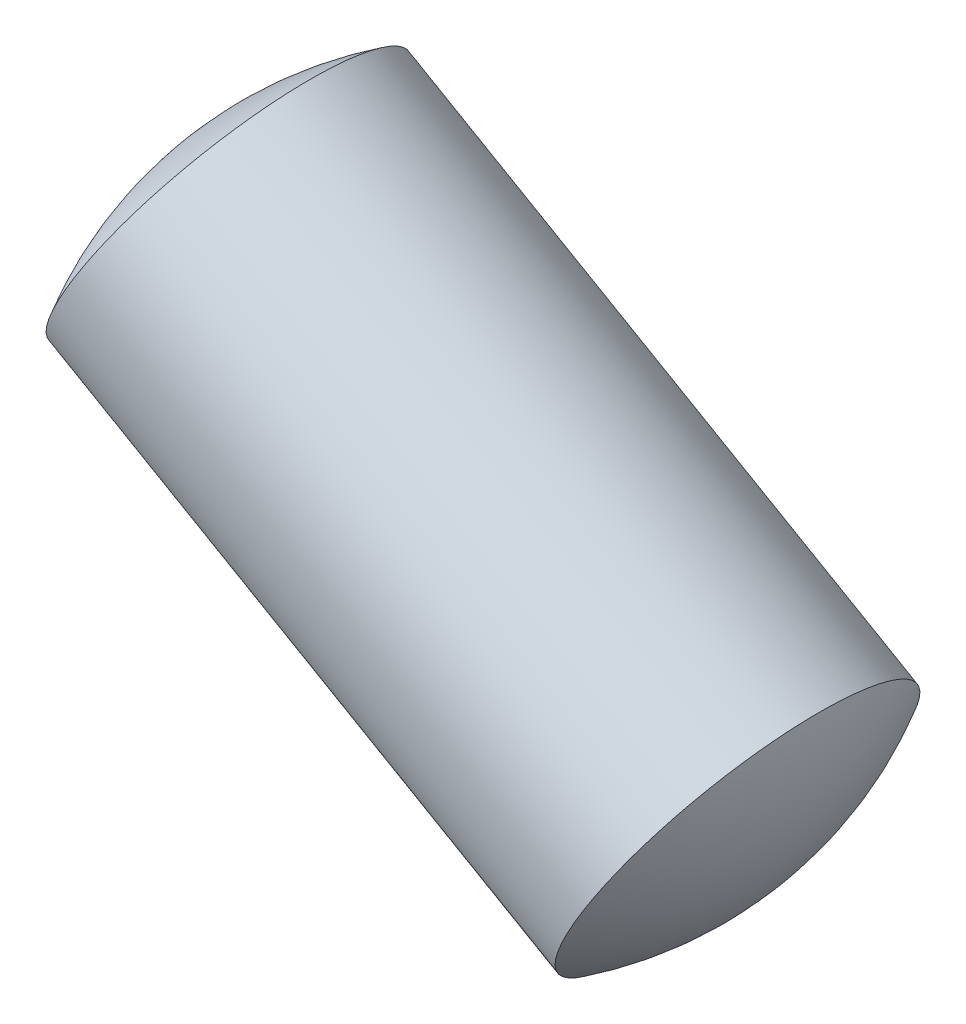
ISO-10303-21;
HEADER;
FILE_DESCRIPTION(('STEP AP214'),'2;1');
FILE_NAME('part.step','',(''),(''),'','','');
FILE_SCHEMA(('AUTOMOTIVE_DESIGN { 1 0 10303 214 1 1 1 1 }'));
ENDSEC;
DATA;
#1=APPLICATION_CONTEXT('core data for automotive mechanical design processes');
#2=APPLICATION_PROTOCOL_DEFINITION('international standard','automotive_design',2000,#1);
#3=PRODUCT_CONTEXT('',#1,'mechanical');
#4=PRODUCT('Part','Part','',(#3));
#5=PRODUCT_RELATED_PRODUCT_CATEGORY('part','',(#4));
#6=PRODUCT_DEFINITION_FORMATION('','',#4);
#7=PRODUCT_DEFINITION_CONTEXT('part definition',#1,'design');
#8=PRODUCT_DEFINITION('design','',#6,#7);
#9=PRODUCT_DEFINITION_SHAPE('','',#8);
#10=(LENGTH_UNIT() NAMED_UNIT(*) SI_UNIT(.MILLI.,.METRE.));
#11=(NAMED_UNIT(*) PLANE_ANGLE_UNIT() SI_UNIT($,.RADIAN.));
#12=(NAMED_UNIT(*) SI_UNIT($,.STERADIAN.) SOLID_ANGLE_UNIT());
#13=UNCERTAINTY_MEASURE_WITH_UNIT(LENGTH_MEASURE(1.E-05),#10,'distance_accuracy_value','');
#14=(GEOMETRIC_REPRESENTATION_CONTEXT(3) GLOBAL_UNCERTAINTY_ASSIGNED_CONTEXT((#13)) GLOBAL_UNIT_ASSIGNED_CONTEXT((#10,
#11,#12)) REPRESENTATION_CONTEXT('',''));
#15=CARTESIAN_POINT('',(0.,0.,0.));
#16=DIRECTION('',(0.,0.,1.));
#17=DIRECTION('',(1.,0.,0.));
#18=AXIS2_PLACEMENT_3D('',#15,#16,#17);
#19=CARTESIAN_POINT('',(-23.9039671942901,13.8009618943233,0.9));
#20=DIRECTION('',(0.5,0.866025403784439,0.));
#21=DIRECTION('',(-0.866025403784439,0.5,0.));
#22=AXIS2_PLACEMENT_3D('',#19,#20,#21);
#23=SPHERICAL_SURFACE('',#22,3.);
#24=CARTESIAN_POINT('',(-23.9039671942901,13.8009618943233,0.9));
#25=DIRECTION('',(0.866025403784439,-0.5,0.));
#26=DIRECTION('',(0.,0.,-1.));
#27=AXIS2_PLACEMENT_3D('',#24,#25,#26);
#28=SPHERICAL_SURFACE('',#27,3.);
#29=CARTESIAN_POINT('',(-26.1539671942901,15.1,0.9));
#30=DIRECTION('',(0.866025403784439,-0.5,0.));
#31=DIRECTION('',(0.,0.,-1.));
#32=AXIS2_PLACEMENT_3D('',#29,#30,#31);
#33=CIRCLE('',#32,1.5);
#34=CARTESIAN_POINT('',(-26.1539671942901,15.1,-0.6));
#35=VERTEX_POINT('',#34);
#36=EDGE_CURVE('E11',#35,#35,#33,.T.);
#37=ORIENTED_EDGE('',*,*,#36,.F.);
#38=EDGE_LOOP('',(#37));
#39=FACE_BOUND('',#38,.T.);
#40=ADVANCED_FACE('F17',(#39),#28,.T.);
#41=CARTESIAN_POINT('',(-23.7274300138541,13.6990381056767,0.9));
#42=DIRECTION('',(0.5,0.866025403784439,0.));
#43=DIRECTION('',(0.866025403784439,-0.5,0.));
#44=AXIS2_PLACEMENT_3D('',#41,#42,#43);
#45=SPHERICAL_SURFACE('',#44,3.);
#46=CARTESIAN_POINT('',(-23.7274300138541,13.6990381056767,0.9));
#47=DIRECTION('',(0.866025403784439,-0.5,0.));
#48=DIRECTION('',(0.,0.,-1.));
#49=AXIS2_PLACEMENT_3D('',#46,#47,#48);
#50=SPHERICAL_SURFACE('',#49,3.);
#51=CARTESIAN_POINT('',(-21.4774300138541,12.4,0.9));
#52=DIRECTION('',(0.866025403784439,-0.5,0.));
#53=DIRECTION('',(0.,0.,-1.));
#54=AXIS2_PLACEMENT_3D('',#51,#52,#53);
#55=CIRCLE('',#54,1.5);
#56=CARTESIAN_POINT('',(-21.4774300138541,12.4,-0.6));
#57=VERTEX_POINT('',#56);
#58=EDGE_CURVE('E21',#57,#57,#55,.T.);
#59=ORIENTED_EDGE('',*,*,#58,.T.);
#60=EDGE_LOOP('',(#59));
#61=FACE_BOUND('',#60,.T.);
#62=ADVANCED_FACE('F40',(#61),#50,.T.);
#63=CARTESIAN_POINT('',(-22.6465643089631,13.075,0.9));
#64=DIRECTION('',(0.866025403784439,-0.5,0.));
#65=DIRECTION('',(0.,0.,-1.));
#66=AXIS2_PLACEMENT_3D('',#63,#64,#65);
#67=CYLINDRICAL_SURFACE('',#66,1.5);
#68=ORIENTED_EDGE('',*,*,#36,.T.);
#69=EDGE_LOOP('',(#68));
#70=FACE_BOUND('',#69,.T.);
#71=ORIENTED_EDGE('',*,*,#58,.F.);
#72=EDGE_LOOP('',(#71));
#73=FACE_BOUND('',#72,.T.);
#74=ADVANCED_FACE('F19',(#70,#73),#67,.T.);
#75=CLOSED_SHELL('',(#40,#62,#74));
#76=MANIFOLD_SOLID_BREP('B1',#75);
#77=ADVANCED_BREP_SHAPE_REPRESENTATION('',(#18,#76),#14);
#78=SHAPE_DEFINITION_REPRESENTATION(#9,#77);
ENDSEC;
END-ISO-10303-21;
